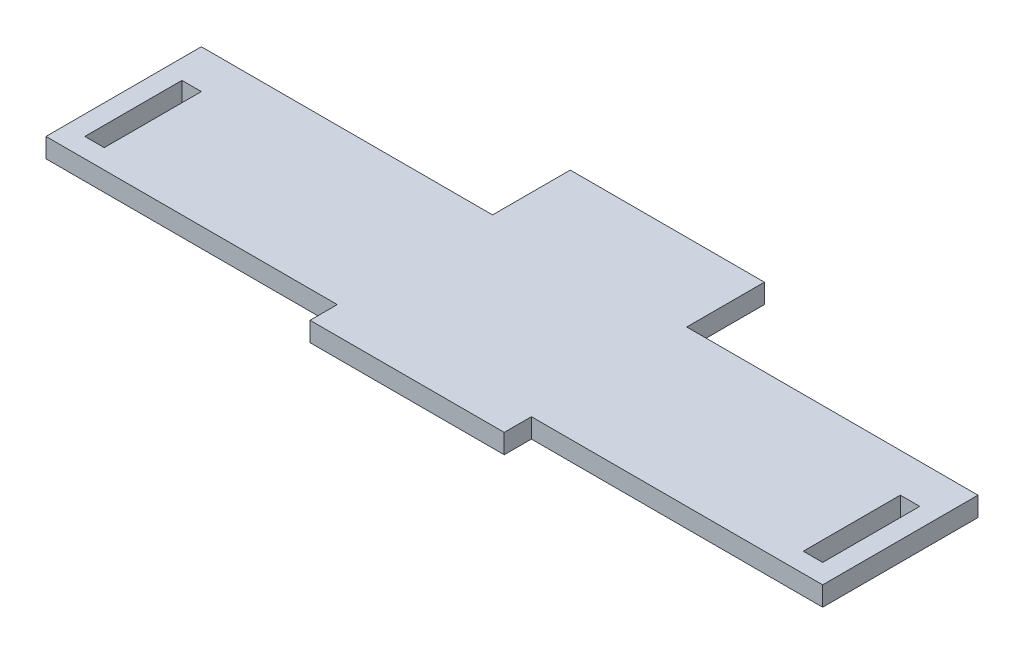
ISO-10303-21;
HEADER;
FILE_DESCRIPTION(('STEP AP214'),'2;1');
FILE_NAME('part.step','',(''),(''),'','','');
FILE_SCHEMA(('AUTOMOTIVE_DESIGN { 1 0 10303 214 1 1 1 1 }'));
ENDSEC;
DATA;
#1=APPLICATION_CONTEXT('core data for automotive mechanical design processes');
#2=APPLICATION_PROTOCOL_DEFINITION('international standard','automotive_design',2000,#1);
#3=PRODUCT_CONTEXT('',#1,'mechanical');
#4=PRODUCT('Part','Part','',(#3));
#5=PRODUCT_RELATED_PRODUCT_CATEGORY('part','',(#4));
#6=PRODUCT_DEFINITION_FORMATION('','',#4);
#7=PRODUCT_DEFINITION_CONTEXT('part definition',#1,'design');
#8=PRODUCT_DEFINITION('design','',#6,#7);
#9=PRODUCT_DEFINITION_SHAPE('','',#8);
#10=(LENGTH_UNIT() NAMED_UNIT(*) SI_UNIT(.MILLI.,.METRE.));
#11=(NAMED_UNIT(*) PLANE_ANGLE_UNIT() SI_UNIT($,.RADIAN.));
#12=(NAMED_UNIT(*) SI_UNIT($,.STERADIAN.) SOLID_ANGLE_UNIT());
#13=UNCERTAINTY_MEASURE_WITH_UNIT(LENGTH_MEASURE(1.E-05),#10,'distance_accuracy_value','');
#14=(GEOMETRIC_REPRESENTATION_CONTEXT(3) GLOBAL_UNCERTAINTY_ASSIGNED_CONTEXT((#13)) GLOBAL_UNIT_ASSIGNED_CONTEXT((#10,
#11,#12)) REPRESENTATION_CONTEXT('',''));
#15=CARTESIAN_POINT('',(0.,0.,0.));
#16=DIRECTION('',(0.,0.,1.));
#17=DIRECTION('',(1.,0.,0.));
#18=AXIS2_PLACEMENT_3D('',#15,#16,#17);
#19=CARTESIAN_POINT('',(95.,5.,0.));
#20=DIRECTION('',(-1.,0.,0.));
#21=DIRECTION('',(0.,0.,1.));
#22=AXIS2_PLACEMENT_3D('',#19,#20,#21);
#23=PLANE('',#22);
#24=DIRECTION('',(0.,0.,-1.));
#25=VECTOR('',#24,1.);
#26=CARTESIAN_POINT('',(95.,0.,0.));
#27=LINE('',#26,#25);
#28=CARTESIAN_POINT('',(95.,0.,6.25));
#29=VERTEX_POINT('',#28);
#30=CARTESIAN_POINT('',(95.,0.,-18.75));
#31=VERTEX_POINT('',#30);
#32=EDGE_CURVE('E280',#29,#31,#27,.T.);
#33=ORIENTED_EDGE('',*,*,#32,.F.);
#34=DIRECTION('',(0.,-1.,0.));
#35=VECTOR('',#34,1.);
#36=CARTESIAN_POINT('',(95.,5.,6.25));
#37=LINE('',#36,#35);
#38=CARTESIAN_POINT('',(95.,5.,6.25));
#39=VERTEX_POINT('',#38);
#40=EDGE_CURVE('E11',#39,#29,#37,.T.);
#41=ORIENTED_EDGE('',*,*,#40,.F.);
#42=DIRECTION('',(0.,0.,-1.));
#43=VECTOR('',#42,1.);
#44=CARTESIAN_POINT('',(95.,5.,0.));
#45=LINE('',#44,#43);
#46=CARTESIAN_POINT('',(95.,5.,-18.75));
#47=VERTEX_POINT('',#46);
#48=EDGE_CURVE('E208',#39,#47,#45,.T.);
#49=ORIENTED_EDGE('',*,*,#48,.T.);
#50=DIRECTION('',(0.,-1.,0.));
#51=VECTOR('',#50,1.);
#52=CARTESIAN_POINT('',(95.,5.,-18.75));
#53=LINE('',#52,#51);
#54=EDGE_CURVE('E132',#47,#31,#53,.T.);
#55=ORIENTED_EDGE('',*,*,#54,.T.);
#56=EDGE_LOOP('',(#33,#41,#49,#55));
#57=FACE_BOUND('',#56,.T.);
#58=ADVANCED_FACE('F41',(#57),#23,.T.);
#59=CARTESIAN_POINT('',(0.,5.,6.25));
#60=DIRECTION('',(0.,0.,-1.));
#61=DIRECTION('',(-1.,0.,0.));
#62=AXIS2_PLACEMENT_3D('',#59,#60,#61);
#63=PLANE('',#62);
#64=DIRECTION('',(1.,0.,0.));
#65=VECTOR('',#64,1.);
#66=CARTESIAN_POINT('',(0.,0.,6.25));
#67=LINE('',#66,#65);
#68=CARTESIAN_POINT('',(90.,0.,6.25));
#69=VERTEX_POINT('',#68);
#70=EDGE_CURVE('E196',#69,#29,#67,.T.);
#71=ORIENTED_EDGE('',*,*,#70,.F.);
#72=DIRECTION('',(0.,-1.,0.));
#73=VECTOR('',#72,1.);
#74=CARTESIAN_POINT('',(90.,5.,6.25));
#75=LINE('',#74,#73);
#76=CARTESIAN_POINT('',(90.,5.,6.25));
#77=VERTEX_POINT('',#76);
#78=EDGE_CURVE('E52',#77,#69,#75,.T.);
#79=ORIENTED_EDGE('',*,*,#78,.F.);
#80=DIRECTION('',(1.,0.,0.));
#81=VECTOR('',#80,1.);
#82=CARTESIAN_POINT('',(0.,5.,6.25));
#83=LINE('',#82,#81);
#84=EDGE_CURVE('E194',#77,#39,#83,.T.);
#85=ORIENTED_EDGE('',*,*,#84,.T.);
#86=ORIENTED_EDGE('',*,*,#40,.T.);
#87=EDGE_LOOP('',(#71,#79,#85,#86));
#88=FACE_BOUND('',#87,.T.);
#89=ADVANCED_FACE('F192',(#88),#63,.T.);
#90=CARTESIAN_POINT('',(90.,5.,0.));
#91=DIRECTION('',(-1.,0.,0.));
#92=DIRECTION('',(0.,0.,1.));
#93=AXIS2_PLACEMENT_3D('',#90,#91,#92);
#94=PLANE('',#93);
#95=DIRECTION('',(0.,0.,-1.));
#96=VECTOR('',#95,1.);
#97=CARTESIAN_POINT('',(90.,0.,0.));
#98=LINE('',#97,#96);
#99=CARTESIAN_POINT('',(90.,0.,-18.75));
#100=VERTEX_POINT('',#99);
#101=EDGE_CURVE('E285',#69,#100,#98,.T.);
#102=ORIENTED_EDGE('',*,*,#101,.T.);
#103=DIRECTION('',(0.,-1.,0.));
#104=VECTOR('',#103,1.);
#105=CARTESIAN_POINT('',(90.,5.,-18.75));
#106=LINE('',#105,#104);
#107=CARTESIAN_POINT('',(90.,5.,-18.75));
#108=VERTEX_POINT('',#107);
#109=EDGE_CURVE('E200',#108,#100,#106,.T.);
#110=ORIENTED_EDGE('',*,*,#109,.F.);
#111=DIRECTION('',(0.,0.,-1.));
#112=VECTOR('',#111,1.);
#113=CARTESIAN_POINT('',(90.,5.,0.));
#114=LINE('',#113,#112);
#115=EDGE_CURVE('E203',#77,#108,#114,.T.);
#116=ORIENTED_EDGE('',*,*,#115,.F.);
#117=ORIENTED_EDGE('',*,*,#78,.T.);
#118=EDGE_LOOP('',(#102,#110,#116,#117));
#119=FACE_BOUND('',#118,.T.);
#120=ADVANCED_FACE('F204',(#119),#94,.F.);
#121=CARTESIAN_POINT('',(-90.,5.,0.));
#122=DIRECTION('',(-1.,0.,0.));
#123=DIRECTION('',(0.,0.,1.));
#124=AXIS2_PLACEMENT_3D('',#121,#122,#123);
#125=PLANE('',#124);
#126=DIRECTION('',(0.,0.,-1.));
#127=VECTOR('',#126,1.);
#128=CARTESIAN_POINT('',(-90.,0.,0.));
#129=LINE('',#128,#127);
#130=CARTESIAN_POINT('',(-90.,0.,6.25000000000001));
#131=VERTEX_POINT('',#130);
#132=CARTESIAN_POINT('',(-90.,0.,-18.75));
#133=VERTEX_POINT('',#132);
#134=EDGE_CURVE('E264',#131,#133,#129,.T.);
#135=ORIENTED_EDGE('',*,*,#134,.F.);
#136=DIRECTION('',(0.,-1.,0.));
#137=VECTOR('',#136,1.);
#138=CARTESIAN_POINT('',(-90.,5.,6.25000000000001));
#139=LINE('',#138,#137);
#140=CARTESIAN_POINT('',(-90.,5.,6.25000000000001));
#141=VERTEX_POINT('',#140);
#142=EDGE_CURVE('E293',#141,#131,#139,.T.);
#143=ORIENTED_EDGE('',*,*,#142,.F.);
#144=DIRECTION('',(0.,0.,-1.));
#145=VECTOR('',#144,1.);
#146=CARTESIAN_POINT('',(-90.,5.,0.));
#147=LINE('',#146,#145);
#148=CARTESIAN_POINT('',(-90.,5.,-18.75));
#149=VERTEX_POINT('',#148);
#150=EDGE_CURVE('E404',#141,#149,#147,.T.);
#151=ORIENTED_EDGE('',*,*,#150,.T.);
#152=DIRECTION('',(0.,-1.,0.));
#153=VECTOR('',#152,1.);
#154=CARTESIAN_POINT('',(-90.,5.,-18.75));
#155=LINE('',#154,#153);
#156=EDGE_CURVE('E296',#149,#133,#155,.T.);
#157=ORIENTED_EDGE('',*,*,#156,.T.);
#158=EDGE_LOOP('',(#135,#143,#151,#157));
#159=FACE_BOUND('',#158,.T.);
#160=ADVANCED_FACE('F429',(#159),#125,.T.);
#161=CARTESIAN_POINT('',(0.,5.,6.25000000000001));
#162=DIRECTION('',(0.,0.,1.));
#163=DIRECTION('',(1.,0.,0.));
#164=AXIS2_PLACEMENT_3D('',#161,#162,#163);
#165=PLANE('',#164);
#166=DIRECTION('',(-1.,0.,0.));
#167=VECTOR('',#166,1.);
#168=CARTESIAN_POINT('',(0.,0.,6.25000000000001));
#169=LINE('',#168,#167);
#170=CARTESIAN_POINT('',(-95.,0.,6.25000000000001));
#171=VERTEX_POINT('',#170);
#172=EDGE_CURVE('E268',#131,#171,#169,.T.);
#173=ORIENTED_EDGE('',*,*,#172,.T.);
#174=DIRECTION('',(0.,-1.,0.));
#175=VECTOR('',#174,1.);
#176=CARTESIAN_POINT('',(-95.,5.,6.25000000000001));
#177=LINE('',#176,#175);
#178=CARTESIAN_POINT('',(-95.,5.,6.25000000000001));
#179=VERTEX_POINT('',#178);
#180=EDGE_CURVE('E302',#179,#171,#177,.T.);
#181=ORIENTED_EDGE('',*,*,#180,.F.);
#182=DIRECTION('',(-1.,0.,0.));
#183=VECTOR('',#182,1.);
#184=CARTESIAN_POINT('',(0.,5.,6.25000000000001));
#185=LINE('',#184,#183);
#186=EDGE_CURVE('E408',#141,#179,#185,.T.);
#187=ORIENTED_EDGE('',*,*,#186,.F.);
#188=ORIENTED_EDGE('',*,*,#142,.T.);
#189=EDGE_LOOP('',(#173,#181,#187,#188));
#190=FACE_BOUND('',#189,.T.);
#191=ADVANCED_FACE('F431',(#190),#165,.F.);
#192=CARTESIAN_POINT('',(-95.,5.,0.));
#193=DIRECTION('',(-1.,0.,0.));
#194=DIRECTION('',(0.,0.,1.));
#195=AXIS2_PLACEMENT_3D('',#192,#193,#194);
#196=PLANE('',#195);
#197=DIRECTION('',(0.,0.,-1.));
#198=VECTOR('',#197,1.);
#199=CARTESIAN_POINT('',(-95.,0.,0.));
#200=LINE('',#199,#198);
#201=CARTESIAN_POINT('',(-95.,0.,-18.75));
#202=VERTEX_POINT('',#201);
#203=EDGE_CURVE('E272',#171,#202,#200,.T.);
#204=ORIENTED_EDGE('',*,*,#203,.T.);
#205=DIRECTION('',(0.,-1.,0.));
#206=VECTOR('',#205,1.);
#207=CARTESIAN_POINT('',(-95.,5.,-18.75));
#208=LINE('',#207,#206);
#209=CARTESIAN_POINT('',(-95.,5.,-18.75));
#210=VERTEX_POINT('',#209);
#211=EDGE_CURVE('E299',#210,#202,#208,.T.);
#212=ORIENTED_EDGE('',*,*,#211,.F.);
#213=DIRECTION('',(0.,0.,-1.));
#214=VECTOR('',#213,1.);
#215=CARTESIAN_POINT('',(-95.,5.,0.));
#216=LINE('',#215,#214);
#217=EDGE_CURVE('E412',#179,#210,#216,.T.);
#218=ORIENTED_EDGE('',*,*,#217,.F.);
#219=ORIENTED_EDGE('',*,*,#180,.T.);
#220=EDGE_LOOP('',(#204,#212,#218,#219));
#221=FACE_BOUND('',#220,.T.);
#222=ADVANCED_FACE('F425',(#221),#196,.F.);
#223=CARTESIAN_POINT('',(24.9999999999999,5.,0.));
#224=DIRECTION('',(1.,0.,0.));
#225=DIRECTION('',(0.,0.,-1.));
#226=AXIS2_PLACEMENT_3D('',#223,#224,#225);
#227=PLANE('',#226);
#228=DIRECTION('',(0.,0.,1.));
#229=VECTOR('',#228,1.);
#230=CARTESIAN_POINT('',(24.9999999999999,0.,0.));
#231=LINE('',#230,#229);
#232=CARTESIAN_POINT('',(24.9999999999999,0.,-48.75));
#233=VERTEX_POINT('',#232);
#234=CARTESIAN_POINT('',(24.9999999999999,0.,-28.75));
#235=VERTEX_POINT('',#234);
#236=EDGE_CURVE('E219',#233,#235,#231,.T.);
#237=ORIENTED_EDGE('',*,*,#236,.F.);
#238=DIRECTION('',(0.,-1.,0.));
#239=VECTOR('',#238,1.);
#240=CARTESIAN_POINT('',(24.9999999999999,5.,-48.75));
#241=LINE('',#240,#239);
#242=CARTESIAN_POINT('',(24.9999999999999,5.,-48.75));
#243=VERTEX_POINT('',#242);
#244=EDGE_CURVE('E45',#243,#233,#241,.T.);
#245=ORIENTED_EDGE('',*,*,#244,.F.);
#246=DIRECTION('',(0.,0.,1.));
#247=VECTOR('',#246,1.);
#248=CARTESIAN_POINT('',(24.9999999999999,5.,0.));
#249=LINE('',#248,#247);
#250=CARTESIAN_POINT('',(24.9999999999999,5.,-28.75));
#251=VERTEX_POINT('',#250);
#252=EDGE_CURVE('E290',#243,#251,#249,.T.);
#253=ORIENTED_EDGE('',*,*,#252,.T.);
#254=DIRECTION('',(0.,-1.,0.));
#255=VECTOR('',#254,1.);
#256=CARTESIAN_POINT('',(24.9999999999999,5.,-28.75));
#257=LINE('',#256,#255);
#258=EDGE_CURVE('E218',#251,#235,#257,.T.);
#259=ORIENTED_EDGE('',*,*,#258,.T.);
#260=EDGE_LOOP('',(#237,#245,#253,#259));
#261=FACE_BOUND('',#260,.T.);
#262=ADVANCED_FACE('F43',(#261),#227,.T.);
#263=CARTESIAN_POINT('',(0.,5.,-48.75));
#264=DIRECTION('',(0.,0.,-1.));
#265=DIRECTION('',(-1.,0.,0.));
#266=AXIS2_PLACEMENT_3D('',#263,#264,#265);
#267=PLANE('',#266);
#268=DIRECTION('',(1.,0.,0.));
#269=VECTOR('',#268,1.);
#270=CARTESIAN_POINT('',(0.,0.,-48.75));
#271=LINE('',#270,#269);
#272=CARTESIAN_POINT('',(-25.,0.,-48.75));
#273=VERTEX_POINT('',#272);
#274=EDGE_CURVE('E223',#273,#233,#271,.T.);
#275=ORIENTED_EDGE('',*,*,#274,.F.);
#276=DIRECTION('',(0.,-1.,0.));
#277=VECTOR('',#276,1.);
#278=CARTESIAN_POINT('',(-25.,5.,-48.75));
#279=LINE('',#278,#277);
#280=CARTESIAN_POINT('',(-25.,5.,-48.75));
#281=VERTEX_POINT('',#280);
#282=EDGE_CURVE('E339',#281,#273,#279,.T.);
#283=ORIENTED_EDGE('',*,*,#282,.F.);
#284=DIRECTION('',(1.,0.,0.));
#285=VECTOR('',#284,1.);
#286=CARTESIAN_POINT('',(0.,5.,-48.75));
#287=LINE('',#286,#285);
#288=EDGE_CURVE('E350',#281,#243,#287,.T.);
#289=ORIENTED_EDGE('',*,*,#288,.T.);
#290=ORIENTED_EDGE('',*,*,#244,.T.);
#291=EDGE_LOOP('',(#275,#283,#289,#290));
#292=FACE_BOUND('',#291,.T.);
#293=ADVANCED_FACE('F348',(#292),#267,.T.);
#294=CARTESIAN_POINT('',(-25.,5.,0.));
#295=DIRECTION('',(-1.,0.,0.));
#296=DIRECTION('',(0.,0.,1.));
#297=AXIS2_PLACEMENT_3D('',#294,#295,#296);
#298=PLANE('',#297);
#299=DIRECTION('',(0.,0.,-1.));
#300=VECTOR('',#299,1.);
#301=CARTESIAN_POINT('',(-25.,0.,0.));
#302=LINE('',#301,#300);
#303=CARTESIAN_POINT('',(-25.,0.,-28.75));
#304=VERTEX_POINT('',#303);
#305=EDGE_CURVE('E227',#304,#273,#302,.T.);
#306=ORIENTED_EDGE('',*,*,#305,.F.);
#307=DIRECTION('',(0.,-1.,0.));
#308=VECTOR('',#307,1.);
#309=CARTESIAN_POINT('',(-25.,5.,-28.75));
#310=LINE('',#309,#308);
#311=CARTESIAN_POINT('',(-25.,5.,-28.75));
#312=VERTEX_POINT('',#311);
#313=EDGE_CURVE('E337',#312,#304,#310,.T.);
#314=ORIENTED_EDGE('',*,*,#313,.F.);
#315=DIRECTION('',(0.,0.,-1.));
#316=VECTOR('',#315,1.);
#317=CARTESIAN_POINT('',(-25.,5.,0.));
#318=LINE('',#317,#316);
#319=EDGE_CURVE('E360',#312,#281,#318,.T.);
#320=ORIENTED_EDGE('',*,*,#319,.T.);
#321=ORIENTED_EDGE('',*,*,#282,.T.);
#322=EDGE_LOOP('',(#306,#314,#320,#321));
#323=FACE_BOUND('',#322,.T.);
#324=ADVANCED_FACE('F357',(#323),#298,.T.);
#325=CARTESIAN_POINT('',(0.,5.,-28.75));
#326=DIRECTION('',(0.,0.,1.));
#327=DIRECTION('',(1.,0.,0.));
#328=AXIS2_PLACEMENT_3D('',#325,#326,#327);
#329=PLANE('',#328);
#330=DIRECTION('',(-1.,0.,0.));
#331=VECTOR('',#330,1.);
#332=CARTESIAN_POINT('',(0.,0.,-28.75));
#333=LINE('',#332,#331);
#334=CARTESIAN_POINT('',(-100.,0.,-28.75));
#335=VERTEX_POINT('',#334);
#336=EDGE_CURVE('E231',#304,#335,#333,.T.);
#337=ORIENTED_EDGE('',*,*,#336,.T.);
#338=DIRECTION('',(0.,-1.,0.));
#339=VECTOR('',#338,1.);
#340=CARTESIAN_POINT('',(-100.,5.,-28.75));
#341=LINE('',#340,#339);
#342=CARTESIAN_POINT('',(-100.,5.,-28.75));
#343=VERTEX_POINT('',#342);
#344=EDGE_CURVE('E333',#343,#335,#341,.T.);
#345=ORIENTED_EDGE('',*,*,#344,.F.);
#346=DIRECTION('',(-1.,0.,0.));
#347=VECTOR('',#346,1.);
#348=CARTESIAN_POINT('',(0.,5.,-28.75));
#349=LINE('',#348,#347);
#350=EDGE_CURVE('E363',#312,#343,#349,.T.);
#351=ORIENTED_EDGE('',*,*,#350,.F.);
#352=ORIENTED_EDGE('',*,*,#313,.T.);
#353=EDGE_LOOP('',(#337,#345,#351,#352));
#354=FACE_BOUND('',#353,.T.);
#355=ADVANCED_FACE('F364',(#354),#329,.F.);
#356=CARTESIAN_POINT('',(-100.,5.,0.));
#357=DIRECTION('',(1.,0.,0.));
#358=DIRECTION('',(0.,0.,-1.));
#359=AXIS2_PLACEMENT_3D('',#356,#357,#358);
#360=PLANE('',#359);
#361=DIRECTION('',(0.,0.,1.));
#362=VECTOR('',#361,1.);
#363=CARTESIAN_POINT('',(-100.,0.,0.));
#364=LINE('',#363,#362);
#365=CARTESIAN_POINT('',(-100.,0.,11.25));
#366=VERTEX_POINT('',#365);
#367=EDGE_CURVE('E234',#335,#366,#364,.T.);
#368=ORIENTED_EDGE('',*,*,#367,.T.);
#369=DIRECTION('',(0.,-1.,0.));
#370=VECTOR('',#369,1.);
#371=CARTESIAN_POINT('',(-100.,5.,11.25));
#372=LINE('',#371,#370);
#373=CARTESIAN_POINT('',(-100.,5.,11.25));
#374=VERTEX_POINT('',#373);
#375=EDGE_CURVE('E330',#374,#366,#372,.T.);
#376=ORIENTED_EDGE('',*,*,#375,.F.);
#377=DIRECTION('',(0.,0.,1.));
#378=VECTOR('',#377,1.);
#379=CARTESIAN_POINT('',(-100.,5.,0.));
#380=LINE('',#379,#378);
#381=EDGE_CURVE('E368',#343,#374,#380,.T.);
#382=ORIENTED_EDGE('',*,*,#381,.F.);
#383=ORIENTED_EDGE('',*,*,#344,.T.);
#384=EDGE_LOOP('',(#368,#376,#382,#383));
#385=FACE_BOUND('',#384,.T.);
#386=ADVANCED_FACE('F483',(#385),#360,.F.);
#387=CARTESIAN_POINT('',(0.,5.,11.25));
#388=DIRECTION('',(0.,0.,1.));
#389=DIRECTION('',(1.,0.,0.));
#390=AXIS2_PLACEMENT_3D('',#387,#388,#389);
#391=PLANE('',#390);
#392=DIRECTION('',(-1.,0.,0.));
#393=VECTOR('',#392,1.);
#394=CARTESIAN_POINT('',(0.,0.,11.25));
#395=LINE('',#394,#393);
#396=CARTESIAN_POINT('',(-25.,0.,11.25));
#397=VERTEX_POINT('',#396);
#398=EDGE_CURVE('E238',#397,#366,#395,.T.);
#399=ORIENTED_EDGE('',*,*,#398,.F.);
#400=DIRECTION('',(0.,-1.,0.));
#401=VECTOR('',#400,1.);
#402=CARTESIAN_POINT('',(-25.,5.,11.25));
#403=LINE('',#402,#401);
#404=CARTESIAN_POINT('',(-25.,5.,11.25));
#405=VERTEX_POINT('',#404);
#406=EDGE_CURVE('E327',#405,#397,#403,.T.);
#407=ORIENTED_EDGE('',*,*,#406,.F.);
#408=DIRECTION('',(-1.,0.,0.));
#409=VECTOR('',#408,1.);
#410=CARTESIAN_POINT('',(0.,5.,11.25));
#411=LINE('',#410,#409);
#412=EDGE_CURVE('E379',#405,#374,#411,.T.);
#413=ORIENTED_EDGE('',*,*,#412,.T.);
#414=ORIENTED_EDGE('',*,*,#375,.T.);
#415=EDGE_LOOP('',(#399,#407,#413,#414));
#416=FACE_BOUND('',#415,.T.);
#417=ADVANCED_FACE('F479',(#416),#391,.T.);
#418=CARTESIAN_POINT('',(-25.,5.,0.));
#419=DIRECTION('',(-1.,0.,0.));
#420=DIRECTION('',(0.,0.,1.));
#421=AXIS2_PLACEMENT_3D('',#418,#419,#420);
#422=PLANE('',#421);
#423=DIRECTION('',(0.,0.,-1.));
#424=VECTOR('',#423,1.);
#425=CARTESIAN_POINT('',(-25.,0.,0.));
#426=LINE('',#425,#424);
#427=CARTESIAN_POINT('',(-25.,0.,18.25));
#428=VERTEX_POINT('',#427);
#429=EDGE_CURVE('E242',#428,#397,#426,.T.);
#430=ORIENTED_EDGE('',*,*,#429,.F.);
#431=DIRECTION('',(0.,-1.,0.));
#432=VECTOR('',#431,1.);
#433=CARTESIAN_POINT('',(-25.,5.,18.25));
#434=LINE('',#433,#432);
#435=CARTESIAN_POINT('',(-25.,5.,18.25));
#436=VERTEX_POINT('',#435);
#437=EDGE_CURVE('E324',#436,#428,#434,.T.);
#438=ORIENTED_EDGE('',*,*,#437,.F.);
#439=DIRECTION('',(0.,0.,-1.));
#440=VECTOR('',#439,1.);
#441=CARTESIAN_POINT('',(-25.,5.,0.));
#442=LINE('',#441,#440);
#443=EDGE_CURVE('E383',#436,#405,#442,.T.);
#444=ORIENTED_EDGE('',*,*,#443,.T.);
#445=ORIENTED_EDGE('',*,*,#406,.T.);
#446=EDGE_LOOP('',(#430,#438,#444,#445));
#447=FACE_BOUND('',#446,.T.);
#448=ADVANCED_FACE('F475',(#447),#422,.T.);
#449=CARTESIAN_POINT('',(0.,5.,18.25));
#450=DIRECTION('',(0.,0.,-1.));
#451=DIRECTION('',(-1.,0.,0.));
#452=AXIS2_PLACEMENT_3D('',#449,#450,#451);
#453=PLANE('',#452);
#454=DIRECTION('',(1.,0.,0.));
#455=VECTOR('',#454,1.);
#456=CARTESIAN_POINT('',(0.,0.,18.25));
#457=LINE('',#456,#455);
#458=CARTESIAN_POINT('',(25.,0.,18.25));
#459=VERTEX_POINT('',#458);
#460=EDGE_CURVE('E246',#428,#459,#457,.T.);
#461=ORIENTED_EDGE('',*,*,#460,.T.);
#462=DIRECTION('',(0.,-1.,0.));
#463=VECTOR('',#462,1.);
#464=CARTESIAN_POINT('',(25.,5.,18.25));
#465=LINE('',#464,#463);
#466=CARTESIAN_POINT('',(25.,5.,18.25));
#467=VERTEX_POINT('',#466);
#468=EDGE_CURVE('E320',#467,#459,#465,.T.);
#469=ORIENTED_EDGE('',*,*,#468,.F.);
#470=DIRECTION('',(1.,0.,0.));
#471=VECTOR('',#470,1.);
#472=CARTESIAN_POINT('',(0.,5.,18.25));
#473=LINE('',#472,#471);
#474=EDGE_CURVE('E387',#436,#467,#473,.T.);
#475=ORIENTED_EDGE('',*,*,#474,.F.);
#476=ORIENTED_EDGE('',*,*,#437,.T.);
#477=EDGE_LOOP('',(#461,#469,#475,#476));
#478=FACE_BOUND('',#477,.T.);
#479=ADVANCED_FACE('F471',(#478),#453,.F.);
#480=CARTESIAN_POINT('',(25.,5.,0.));
#481=DIRECTION('',(-1.,0.,0.));
#482=DIRECTION('',(0.,0.,1.));
#483=AXIS2_PLACEMENT_3D('',#480,#481,#482);
#484=PLANE('',#483);
#485=DIRECTION('',(0.,0.,-1.));
#486=VECTOR('',#485,1.);
#487=CARTESIAN_POINT('',(25.,0.,0.));
#488=LINE('',#487,#486);
#489=CARTESIAN_POINT('',(25.,0.,11.25));
#490=VERTEX_POINT('',#489);
#491=EDGE_CURVE('E249',#459,#490,#488,.T.);
#492=ORIENTED_EDGE('',*,*,#491,.T.);
#493=DIRECTION('',(0.,-1.,0.));
#494=VECTOR('',#493,1.);
#495=CARTESIAN_POINT('',(25.,5.,11.25));
#496=LINE('',#495,#494);
#497=CARTESIAN_POINT('',(25.,5.,11.25));
#498=VERTEX_POINT('',#497);
#499=EDGE_CURVE('E316',#498,#490,#496,.T.);
#500=ORIENTED_EDGE('',*,*,#499,.F.);
#501=DIRECTION('',(0.,0.,-1.));
#502=VECTOR('',#501,1.);
#503=CARTESIAN_POINT('',(25.,5.,0.));
#504=LINE('',#503,#502);
#505=EDGE_CURVE('E390',#467,#498,#504,.T.);
#506=ORIENTED_EDGE('',*,*,#505,.F.);
#507=ORIENTED_EDGE('',*,*,#468,.T.);
#508=EDGE_LOOP('',(#492,#500,#506,#507));
#509=FACE_BOUND('',#508,.T.);
#510=ADVANCED_FACE('F464',(#509),#484,.F.);
#511=CARTESIAN_POINT('',(0.,5.,11.25));
#512=DIRECTION('',(0.,0.,-1.));
#513=DIRECTION('',(-1.,0.,0.));
#514=AXIS2_PLACEMENT_3D('',#511,#512,#513);
#515=PLANE('',#514);
#516=DIRECTION('',(1.,0.,0.));
#517=VECTOR('',#516,1.);
#518=CARTESIAN_POINT('',(0.,0.,11.25));
#519=LINE('',#518,#517);
#520=CARTESIAN_POINT('',(99.9999999999999,0.,11.25));
#521=VERTEX_POINT('',#520);
#522=EDGE_CURVE('E252',#490,#521,#519,.T.);
#523=ORIENTED_EDGE('',*,*,#522,.T.);
#524=DIRECTION('',(0.,-1.,0.));
#525=VECTOR('',#524,1.);
#526=CARTESIAN_POINT('',(99.9999999999999,5.,11.25));
#527=LINE('',#526,#525);
#528=CARTESIAN_POINT('',(99.9999999999999,5.,11.25));
#529=VERTEX_POINT('',#528);
#530=EDGE_CURVE('E313',#529,#521,#527,.T.);
#531=ORIENTED_EDGE('',*,*,#530,.F.);
#532=DIRECTION('',(1.,0.,0.));
#533=VECTOR('',#532,1.);
#534=CARTESIAN_POINT('',(0.,5.,11.25));
#535=LINE('',#534,#533);
#536=EDGE_CURVE('E393',#498,#529,#535,.T.);
#537=ORIENTED_EDGE('',*,*,#536,.F.);
#538=ORIENTED_EDGE('',*,*,#499,.T.);
#539=EDGE_LOOP('',(#523,#531,#537,#538));
#540=FACE_BOUND('',#539,.T.);
#541=ADVANCED_FACE('F458',(#540),#515,.F.);
#542=CARTESIAN_POINT('',(99.9999999999999,5.,1.04083408558609E-13));
#543=DIRECTION('',(1.,0.,0.));
#544=DIRECTION('',(0.,0.,-1.));
#545=AXIS2_PLACEMENT_3D('',#542,#543,#544);
#546=PLANE('',#545);
#547=DIRECTION('',(0.,0.,1.));
#548=VECTOR('',#547,1.);
#549=CARTESIAN_POINT('',(99.9999999999999,0.,1.04083408558609E-13));
#550=LINE('',#549,#548);
#551=CARTESIAN_POINT('',(100.,0.,-28.75));
#552=VERTEX_POINT('',#551);
#553=EDGE_CURVE('E256',#552,#521,#550,.T.);
#554=ORIENTED_EDGE('',*,*,#553,.F.);
#555=DIRECTION('',(0.,-1.,0.));
#556=VECTOR('',#555,1.);
#557=CARTESIAN_POINT('',(100.,5.,-28.75));
#558=LINE('',#557,#556);
#559=CARTESIAN_POINT('',(100.,5.,-28.75));
#560=VERTEX_POINT('',#559);
#561=EDGE_CURVE('E310',#560,#552,#558,.T.);
#562=ORIENTED_EDGE('',*,*,#561,.F.);
#563=DIRECTION('',(0.,0.,1.));
#564=VECTOR('',#563,1.);
#565=CARTESIAN_POINT('',(99.9999999999999,5.,1.04083408558609E-13));
#566=LINE('',#565,#564);
#567=EDGE_CURVE('E396',#560,#529,#566,.T.);
#568=ORIENTED_EDGE('',*,*,#567,.T.);
#569=ORIENTED_EDGE('',*,*,#530,.T.);
#570=EDGE_LOOP('',(#554,#562,#568,#569));
#571=FACE_BOUND('',#570,.T.);
#572=ADVANCED_FACE('F450',(#571),#546,.T.);
#573=CARTESIAN_POINT('',(0.,5.,-18.75));
#574=DIRECTION('',(0.,0.,1.));
#575=DIRECTION('',(1.,0.,0.));
#576=AXIS2_PLACEMENT_3D('',#573,#574,#575);
#577=PLANE('',#576);
#578=DIRECTION('',(-1.,0.,0.));
#579=VECTOR('',#578,1.);
#580=CARTESIAN_POINT('',(0.,0.,-18.75));
#581=LINE('',#580,#579);
#582=EDGE_CURVE('E276',#133,#202,#581,.T.);
#583=ORIENTED_EDGE('',*,*,#582,.F.);
#584=ORIENTED_EDGE('',*,*,#156,.F.);
#585=DIRECTION('',(-1.,0.,0.));
#586=VECTOR('',#585,1.);
#587=CARTESIAN_POINT('',(0.,5.,-18.75));
#588=LINE('',#587,#586);
#589=EDGE_CURVE('E212',#149,#210,#588,.T.);
#590=ORIENTED_EDGE('',*,*,#589,.T.);
#591=ORIENTED_EDGE('',*,*,#211,.T.);
#592=EDGE_LOOP('',(#583,#584,#590,#591));
#593=FACE_BOUND('',#592,.T.);
#594=ADVANCED_FACE('F419',(#593),#577,.T.);
#595=CARTESIAN_POINT('',(0.,5.,-28.75));
#596=DIRECTION('',(0.,0.,-1.));
#597=DIRECTION('',(-1.,0.,0.));
#598=AXIS2_PLACEMENT_3D('',#595,#596,#597);
#599=PLANE('',#598);
#600=DIRECTION('',(1.,0.,0.));
#601=VECTOR('',#600,1.);
#602=CARTESIAN_POINT('',(0.,0.,-28.75));
#603=LINE('',#602,#601);
#604=EDGE_CURVE('E260',#235,#552,#603,.T.);
#605=ORIENTED_EDGE('',*,*,#604,.F.);
#606=ORIENTED_EDGE('',*,*,#258,.F.);
#607=DIRECTION('',(1.,0.,0.));
#608=VECTOR('',#607,1.);
#609=CARTESIAN_POINT('',(0.,5.,-28.75));
#610=LINE('',#609,#608);
#611=EDGE_CURVE('E400',#251,#560,#610,.T.);
#612=ORIENTED_EDGE('',*,*,#611,.T.);
#613=ORIENTED_EDGE('',*,*,#561,.T.);
#614=EDGE_LOOP('',(#605,#606,#612,#613));
#615=FACE_BOUND('',#614,.T.);
#616=ADVANCED_FACE('F449',(#615),#599,.T.);
#617=CARTESIAN_POINT('',(0.,5.,-18.75));
#618=DIRECTION('',(0.,0.,-1.));
#619=DIRECTION('',(-1.,0.,0.));
#620=AXIS2_PLACEMENT_3D('',#617,#618,#619);
#621=PLANE('',#620);
#622=DIRECTION('',(1.,0.,0.));
#623=VECTOR('',#622,1.);
#624=CARTESIAN_POINT('',(0.,0.,-18.75));
#625=LINE('',#624,#623);
#626=EDGE_CURVE('E125',#100,#31,#625,.T.);
#627=ORIENTED_EDGE('',*,*,#626,.T.);
#628=ORIENTED_EDGE('',*,*,#54,.F.);
#629=DIRECTION('',(1.,0.,0.));
#630=VECTOR('',#629,1.);
#631=CARTESIAN_POINT('',(0.,5.,-18.75));
#632=LINE('',#631,#630);
#633=EDGE_CURVE('E61',#108,#47,#632,.T.);
#634=ORIENTED_EDGE('',*,*,#633,.F.);
#635=ORIENTED_EDGE('',*,*,#109,.T.);
#636=EDGE_LOOP('',(#627,#628,#634,#635));
#637=FACE_BOUND('',#636,.T.);
#638=ADVANCED_FACE('F455',(#637),#621,.F.);
#639=CARTESIAN_POINT('',(0.,5.,0.));
#640=DIRECTION('',(0.,1.,0.));
#641=DIRECTION('',(0.,0.,1.));
#642=AXIS2_PLACEMENT_3D('',#639,#640,#641);
#643=PLANE('',#642);
#644=ORIENTED_EDGE('',*,*,#252,.F.);
#645=ORIENTED_EDGE('',*,*,#288,.F.);
#646=ORIENTED_EDGE('',*,*,#319,.F.);
#647=ORIENTED_EDGE('',*,*,#350,.T.);
#648=ORIENTED_EDGE('',*,*,#381,.T.);
#649=ORIENTED_EDGE('',*,*,#412,.F.);
#650=ORIENTED_EDGE('',*,*,#443,.F.);
#651=ORIENTED_EDGE('',*,*,#474,.T.);
#652=ORIENTED_EDGE('',*,*,#505,.T.);
#653=ORIENTED_EDGE('',*,*,#536,.T.);
#654=ORIENTED_EDGE('',*,*,#567,.F.);
#655=ORIENTED_EDGE('',*,*,#611,.F.);
#656=EDGE_LOOP('',(#644,#645,#646,#647,#648,#649,#650,#651,#652,#653,#654,#655));
#657=FACE_BOUND('',#656,.T.);
#658=ORIENTED_EDGE('',*,*,#150,.F.);
#659=ORIENTED_EDGE('',*,*,#186,.T.);
#660=ORIENTED_EDGE('',*,*,#217,.T.);
#661=ORIENTED_EDGE('',*,*,#589,.F.);
#662=EDGE_LOOP('',(#658,#659,#660,#661));
#663=FACE_BOUND('',#662,.T.);
#664=ORIENTED_EDGE('',*,*,#48,.F.);
#665=ORIENTED_EDGE('',*,*,#84,.F.);
#666=ORIENTED_EDGE('',*,*,#115,.T.);
#667=ORIENTED_EDGE('',*,*,#633,.T.);
#668=EDGE_LOOP('',(#664,#665,#666,#667));
#669=FACE_BOUND('',#668,.T.);
#670=ADVANCED_FACE('F207',(#657,#663,#669),#643,.T.);
#671=CARTESIAN_POINT('',(0.,0.,0.));
#672=DIRECTION('',(0.,1.,0.));
#673=DIRECTION('',(0.,0.,1.));
#674=AXIS2_PLACEMENT_3D('',#671,#672,#673);
#675=PLANE('',#674);
#676=ORIENTED_EDGE('',*,*,#236,.T.);
#677=ORIENTED_EDGE('',*,*,#604,.T.);
#678=ORIENTED_EDGE('',*,*,#553,.T.);
#679=ORIENTED_EDGE('',*,*,#522,.F.);
#680=ORIENTED_EDGE('',*,*,#491,.F.);
#681=ORIENTED_EDGE('',*,*,#460,.F.);
#682=ORIENTED_EDGE('',*,*,#429,.T.);
#683=ORIENTED_EDGE('',*,*,#398,.T.);
#684=ORIENTED_EDGE('',*,*,#367,.F.);
#685=ORIENTED_EDGE('',*,*,#336,.F.);
#686=ORIENTED_EDGE('',*,*,#305,.T.);
#687=ORIENTED_EDGE('',*,*,#274,.T.);
#688=EDGE_LOOP('',(#676,#677,#678,#679,#680,#681,#682,#683,#684,#685,#686,#687));
#689=FACE_BOUND('',#688,.T.);
#690=ORIENTED_EDGE('',*,*,#134,.T.);
#691=ORIENTED_EDGE('',*,*,#582,.T.);
#692=ORIENTED_EDGE('',*,*,#203,.F.);
#693=ORIENTED_EDGE('',*,*,#172,.F.);
#694=EDGE_LOOP('',(#690,#691,#692,#693));
#695=FACE_BOUND('',#694,.T.);
#696=ORIENTED_EDGE('',*,*,#32,.T.);
#697=ORIENTED_EDGE('',*,*,#626,.F.);
#698=ORIENTED_EDGE('',*,*,#101,.F.);
#699=ORIENTED_EDGE('',*,*,#70,.T.);
#700=EDGE_LOOP('',(#696,#697,#698,#699));
#701=FACE_BOUND('',#700,.T.);
#702=ADVANCED_FACE('F353',(#689,#695,#701),#675,.F.);
#703=CLOSED_SHELL('',(#58,#89,#120,#160,#191,#222,#262,#293,#324,#355,#386,#417,#448,#479,#510,
#541,#572,#594,#616,#638,#670,#702));
#704=MANIFOLD_SOLID_BREP('B2',#703);
#705=ADVANCED_BREP_SHAPE_REPRESENTATION('',(#18,#704),#14);
#706=SHAPE_DEFINITION_REPRESENTATION(#9,#705);
ENDSEC;
END-ISO-10303-21;
